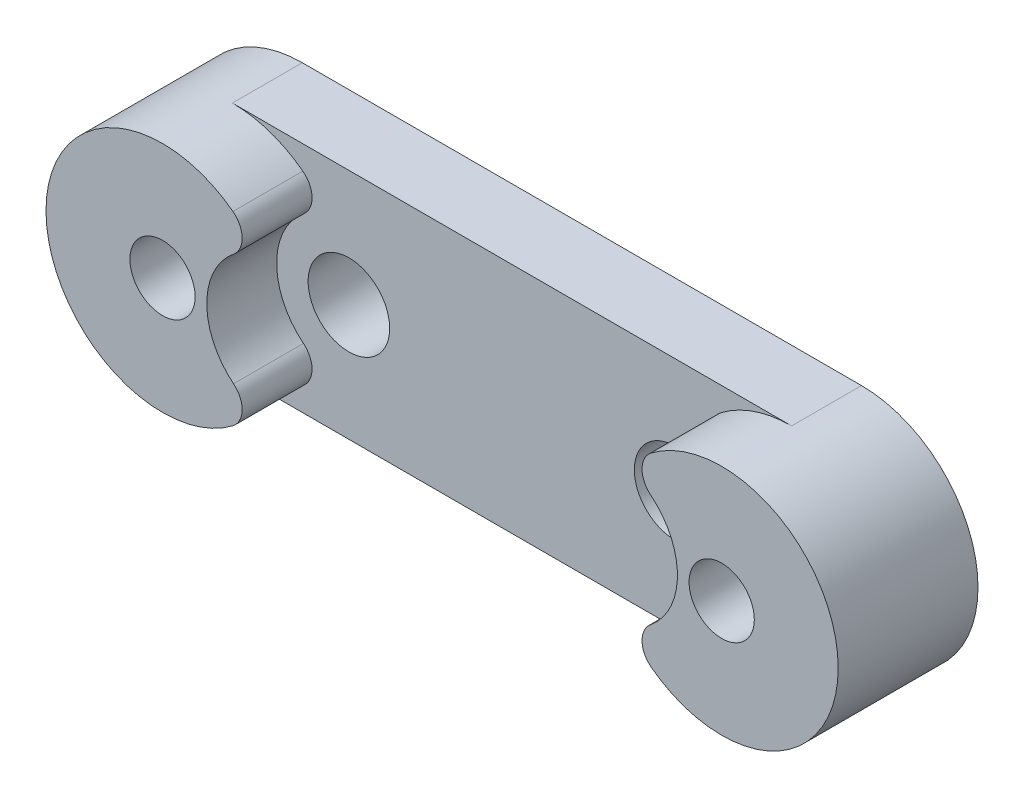
ISO-10303-21;
HEADER;
FILE_DESCRIPTION(('STEP AP214'),'2;1');
FILE_NAME('part.step','',(''),(''),'','','');
FILE_SCHEMA(('AUTOMOTIVE_DESIGN { 1 0 10303 214 1 1 1 1 }'));
ENDSEC;
DATA;
#1=APPLICATION_CONTEXT('core data for automotive mechanical design processes');
#2=APPLICATION_PROTOCOL_DEFINITION('international standard','automotive_design',2000,#1);
#3=PRODUCT_CONTEXT('',#1,'mechanical');
#4=PRODUCT('Part','Part','',(#3));
#5=PRODUCT_RELATED_PRODUCT_CATEGORY('part','',(#4));
#6=PRODUCT_DEFINITION_FORMATION('','',#4);
#7=PRODUCT_DEFINITION_CONTEXT('part definition',#1,'design');
#8=PRODUCT_DEFINITION('design','',#6,#7);
#9=PRODUCT_DEFINITION_SHAPE('','',#8);
#10=(LENGTH_UNIT() NAMED_UNIT(*) SI_UNIT(.MILLI.,.METRE.));
#11=(NAMED_UNIT(*) PLANE_ANGLE_UNIT() SI_UNIT($,.RADIAN.));
#12=(NAMED_UNIT(*) SI_UNIT($,.STERADIAN.) SOLID_ANGLE_UNIT());
#13=UNCERTAINTY_MEASURE_WITH_UNIT(LENGTH_MEASURE(1.E-05),#10,'distance_accuracy_value','');
#14=(GEOMETRIC_REPRESENTATION_CONTEXT(3) GLOBAL_UNCERTAINTY_ASSIGNED_CONTEXT((#13)) GLOBAL_UNIT_ASSIGNED_CONTEXT((#10,
#11,#12)) REPRESENTATION_CONTEXT('',''));
#15=CARTESIAN_POINT('',(0.,0.,0.));
#16=DIRECTION('',(0.,0.,1.));
#17=DIRECTION('',(1.,0.,0.));
#18=AXIS2_PLACEMENT_3D('',#15,#16,#17);
#19=CARTESIAN_POINT('',(-12.,0.,3.));
#20=DIRECTION('',(0.,0.,1.));
#21=DIRECTION('',(1.,0.,0.));
#22=AXIS2_PLACEMENT_3D('',#19,#20,#21);
#23=PLANE('',#22);
#24=CARTESIAN_POINT('',(7.,0.,3.));
#25=DIRECTION('',(0.,0.,1.));
#26=DIRECTION('',(-1.,0.,0.));
#27=AXIS2_PLACEMENT_3D('',#24,#25,#26);
#28=CIRCLE('',#27,1.75);
#29=CARTESIAN_POINT('',(5.25,0.,3.));
#30=VERTEX_POINT('',#29);
#31=EDGE_CURVE('E234',#30,#30,#28,.T.);
#32=ORIENTED_EDGE('',*,*,#31,.F.);
#33=EDGE_LOOP('',(#32));
#34=FACE_BOUND('',#33,.T.);
#35=CARTESIAN_POINT('',(-7.,0.,3.));
#36=DIRECTION('',(0.,0.,1.));
#37=DIRECTION('',(1.,0.,0.));
#38=AXIS2_PLACEMENT_3D('',#35,#36,#37);
#39=CIRCLE('',#38,1.75);
#40=CARTESIAN_POINT('',(-5.25,0.,3.));
#41=VERTEX_POINT('',#40);
#42=EDGE_CURVE('E240',#41,#41,#39,.T.);
#43=ORIENTED_EDGE('',*,*,#42,.F.);
#44=EDGE_LOOP('',(#43));
#45=FACE_BOUND('',#44,.T.);
#46=CARTESIAN_POINT('',(12.,0.,3.));
#47=DIRECTION('',(0.,0.,1.));
#48=DIRECTION('',(1.,0.,0.));
#49=AXIS2_PLACEMENT_3D('',#46,#47,#48);
#50=CIRCLE('',#49,5.);
#51=CARTESIAN_POINT('',(8.97625,-3.98207683721698,3.));
#52=VERTEX_POINT('',#51);
#53=CARTESIAN_POINT('',(12.,-5.,3.));
#54=VERTEX_POINT('',#53);
#55=EDGE_CURVE('E187',#52,#54,#50,.T.);
#56=ORIENTED_EDGE('',*,*,#55,.F.);
#57=CARTESIAN_POINT('',(9.581,-3.18566146977358,3.));
#58=DIRECTION('',(0.,0.,1.));
#59=DIRECTION('',(1.,0.,0.));
#60=AXIS2_PLACEMENT_3D('',#57,#58,#59);
#61=CIRCLE('',#60,1.);
#62=CARTESIAN_POINT('',(8.95148780487805,-2.40867086738978,3.));
#63=VERTEX_POINT('',#62);
#64=EDGE_CURVE('E181',#52,#63,#61,.F.);
#65=ORIENTED_EDGE('',*,*,#64,.T.);
#66=CARTESIAN_POINT('',(7.,0.,3.));
#67=DIRECTION('',(0.,0.,1.));
#68=DIRECTION('',(1.,0.,0.));
#69=AXIS2_PLACEMENT_3D('',#66,#67,#68);
#70=CIRCLE('',#69,3.1);
#71=CARTESIAN_POINT('',(8.95148780487805,2.40867086738978,3.));
#72=VERTEX_POINT('',#71);
#73=EDGE_CURVE('E185',#72,#63,#70,.F.);
#74=ORIENTED_EDGE('',*,*,#73,.F.);
#75=CARTESIAN_POINT('',(9.581,3.18566146977359,3.));
#76=DIRECTION('',(0.,0.,1.));
#77=DIRECTION('',(1.,0.,0.));
#78=AXIS2_PLACEMENT_3D('',#75,#76,#77);
#79=CIRCLE('',#78,1.);
#80=CARTESIAN_POINT('',(8.97624999999999,3.98207683721698,3.));
#81=VERTEX_POINT('',#80);
#82=EDGE_CURVE('E179',#72,#81,#79,.F.);
#83=ORIENTED_EDGE('',*,*,#82,.T.);
#84=CARTESIAN_POINT('',(12.,5.,3.));
#85=VERTEX_POINT('',#84);
#86=EDGE_CURVE('E219',#85,#81,#50,.T.);
#87=ORIENTED_EDGE('',*,*,#86,.F.);
#88=DIRECTION('',(-1.,0.,0.));
#89=VECTOR('',#88,1.);
#90=CARTESIAN_POINT('',(-12.,5.,3.));
#91=LINE('',#90,#89);
#92=CARTESIAN_POINT('',(-12.,5.,3.));
#93=VERTEX_POINT('',#92);
#94=EDGE_CURVE('E141',#85,#93,#91,.T.);
#95=ORIENTED_EDGE('',*,*,#94,.T.);
#96=CARTESIAN_POINT('',(-12.,0.,3.));
#97=DIRECTION('',(0.,0.,1.));
#98=DIRECTION('',(1.,0.,0.));
#99=AXIS2_PLACEMENT_3D('',#96,#97,#98);
#100=CIRCLE('',#99,5.);
#101=CARTESIAN_POINT('',(-8.97625,3.98207683721698,3.));
#102=VERTEX_POINT('',#101);
#103=EDGE_CURVE('E131',#102,#93,#100,.T.);
#104=ORIENTED_EDGE('',*,*,#103,.F.);
#105=CARTESIAN_POINT('',(-9.581,3.18566146977359,3.));
#106=DIRECTION('',(0.,0.,1.));
#107=DIRECTION('',(1.,0.,0.));
#108=AXIS2_PLACEMENT_3D('',#105,#106,#107);
#109=CIRCLE('',#108,1.);
#110=CARTESIAN_POINT('',(-8.95148780487805,2.40867086738978,3.));
#111=VERTEX_POINT('',#110);
#112=EDGE_CURVE('E11',#102,#111,#109,.F.);
#113=ORIENTED_EDGE('',*,*,#112,.T.);
#114=CARTESIAN_POINT('',(-7.,0.,3.));
#115=DIRECTION('',(0.,0.,1.));
#116=DIRECTION('',(1.,0.,0.));
#117=AXIS2_PLACEMENT_3D('',#114,#115,#116);
#118=CIRCLE('',#117,3.1);
#119=CARTESIAN_POINT('',(-8.95148780487805,-2.40867086738978,3.));
#120=VERTEX_POINT('',#119);
#121=EDGE_CURVE('E231',#120,#111,#118,.F.);
#122=ORIENTED_EDGE('',*,*,#121,.F.);
#123=CARTESIAN_POINT('',(-9.581,-3.18566146977359,3.));
#124=DIRECTION('',(0.,0.,1.));
#125=DIRECTION('',(1.,0.,0.));
#126=AXIS2_PLACEMENT_3D('',#123,#124,#125);
#127=CIRCLE('',#126,1.);
#128=CARTESIAN_POINT('',(-8.97625,-3.98207683721698,3.));
#129=VERTEX_POINT('',#128);
#130=EDGE_CURVE('E41',#120,#129,#127,.F.);
#131=ORIENTED_EDGE('',*,*,#130,.T.);
#132=CARTESIAN_POINT('',(-12.,-5.,3.));
#133=VERTEX_POINT('',#132);
#134=EDGE_CURVE('E121',#133,#129,#100,.T.);
#135=ORIENTED_EDGE('',*,*,#134,.F.);
#136=DIRECTION('',(1.,0.,0.));
#137=VECTOR('',#136,1.);
#138=CARTESIAN_POINT('',(-12.,-5.,3.));
#139=LINE('',#138,#137);
#140=EDGE_CURVE('E124',#133,#54,#139,.T.);
#141=ORIENTED_EDGE('',*,*,#140,.T.);
#142=EDGE_LOOP('',(#56,#65,#74,#83,#87,#95,#104,#113,#122,#131,#135,#141));
#143=FACE_BOUND('',#142,.T.);
#144=ADVANCED_FACE('F33',(#34,#45,#143),#23,.T.);
#145=CARTESIAN_POINT('',(-12.,0.,0.));
#146=DIRECTION('',(0.,0.,1.));
#147=DIRECTION('',(1.,0.,0.));
#148=AXIS2_PLACEMENT_3D('',#145,#146,#147);
#149=PLANE('',#148);
#150=CARTESIAN_POINT('',(12.,0.,0.));
#151=DIRECTION('',(0.,0.,1.));
#152=DIRECTION('',(1.,0.,0.));
#153=AXIS2_PLACEMENT_3D('',#150,#151,#152);
#154=CIRCLE('',#153,5.);
#155=CARTESIAN_POINT('',(12.,-5.,0.));
#156=VERTEX_POINT('',#155);
#157=CARTESIAN_POINT('',(12.,5.,0.));
#158=VERTEX_POINT('',#157);
#159=EDGE_CURVE('E251',#156,#158,#154,.T.);
#160=ORIENTED_EDGE('',*,*,#159,.F.);
#161=DIRECTION('',(1.,0.,0.));
#162=VECTOR('',#161,1.);
#163=CARTESIAN_POINT('',(-12.,-5.,0.));
#164=LINE('',#163,#162);
#165=CARTESIAN_POINT('',(-12.,-5.,0.));
#166=VERTEX_POINT('',#165);
#167=EDGE_CURVE('E249',#166,#156,#164,.T.);
#168=ORIENTED_EDGE('',*,*,#167,.F.);
#169=CARTESIAN_POINT('',(-12.,0.,0.));
#170=DIRECTION('',(0.,0.,1.));
#171=DIRECTION('',(1.,0.,0.));
#172=AXIS2_PLACEMENT_3D('',#169,#170,#171);
#173=CIRCLE('',#172,5.);
#174=CARTESIAN_POINT('',(-12.,5.,0.));
#175=VERTEX_POINT('',#174);
#176=EDGE_CURVE('E147',#175,#166,#173,.T.);
#177=ORIENTED_EDGE('',*,*,#176,.F.);
#178=DIRECTION('',(-1.,0.,0.));
#179=VECTOR('',#178,1.);
#180=CARTESIAN_POINT('',(-12.,5.,0.));
#181=LINE('',#180,#179);
#182=EDGE_CURVE('E142',#158,#175,#181,.T.);
#183=ORIENTED_EDGE('',*,*,#182,.F.);
#184=EDGE_LOOP('',(#160,#168,#177,#183));
#185=FACE_BOUND('',#184,.T.);
#186=CARTESIAN_POINT('',(12.,0.,0.));
#187=DIRECTION('',(0.,0.,1.));
#188=DIRECTION('',(1.,0.,0.));
#189=AXIS2_PLACEMENT_3D('',#186,#187,#188);
#190=CIRCLE('',#189,1.4);
#191=CARTESIAN_POINT('',(13.4,0.,0.));
#192=VERTEX_POINT('',#191);
#193=EDGE_CURVE('E212',#192,#192,#190,.T.);
#194=ORIENTED_EDGE('',*,*,#193,.T.);
#195=EDGE_LOOP('',(#194));
#196=FACE_BOUND('',#195,.T.);
#197=CARTESIAN_POINT('',(-12.,0.,0.));
#198=DIRECTION('',(0.,0.,1.));
#199=DIRECTION('',(1.,0.,0.));
#200=AXIS2_PLACEMENT_3D('',#197,#198,#199);
#201=CIRCLE('',#200,1.4);
#202=CARTESIAN_POINT('',(-10.6,0.,0.));
#203=VERTEX_POINT('',#202);
#204=EDGE_CURVE('E132',#203,#203,#201,.T.);
#205=ORIENTED_EDGE('',*,*,#204,.T.);
#206=EDGE_LOOP('',(#205));
#207=FACE_BOUND('',#206,.T.);
#208=CARTESIAN_POINT('',(7.,0.,0.));
#209=DIRECTION('',(0.,0.,1.));
#210=DIRECTION('',(-1.,0.,0.));
#211=AXIS2_PLACEMENT_3D('',#208,#209,#210);
#212=CIRCLE('',#211,1.75);
#213=CARTESIAN_POINT('',(5.25,0.,0.));
#214=VERTEX_POINT('',#213);
#215=EDGE_CURVE('E233',#214,#214,#212,.T.);
#216=ORIENTED_EDGE('',*,*,#215,.T.);
#217=EDGE_LOOP('',(#216));
#218=FACE_BOUND('',#217,.T.);
#219=CARTESIAN_POINT('',(-7.,0.,0.));
#220=DIRECTION('',(0.,0.,1.));
#221=DIRECTION('',(1.,0.,0.));
#222=AXIS2_PLACEMENT_3D('',#219,#220,#221);
#223=CIRCLE('',#222,1.75);
#224=CARTESIAN_POINT('',(-5.25,0.,0.));
#225=VERTEX_POINT('',#224);
#226=EDGE_CURVE('E237',#225,#225,#223,.T.);
#227=ORIENTED_EDGE('',*,*,#226,.T.);
#228=EDGE_LOOP('',(#227));
#229=FACE_BOUND('',#228,.T.);
#230=ADVANCED_FACE('F263',(#185,#196,#207,#218,#229),#149,.F.);
#231=CARTESIAN_POINT('',(-12.,0.,3.));
#232=DIRECTION('',(0.,0.,-1.));
#233=DIRECTION('',(-1.,0.,0.));
#234=AXIS2_PLACEMENT_3D('',#231,#232,#233);
#235=CYLINDRICAL_SURFACE('',#234,5.);
#236=ORIENTED_EDGE('',*,*,#134,.T.);
#237=DIRECTION('',(0.,0.,-1.));
#238=VECTOR('',#237,1.);
#239=CARTESIAN_POINT('',(-8.97625,-3.98207683721698,3.));
#240=LINE('',#239,#238);
#241=CARTESIAN_POINT('',(-8.97625,-3.98207683721698,6.));
#242=VERTEX_POINT('',#241);
#243=EDGE_CURVE('E169',#129,#242,#240,.F.);
#244=ORIENTED_EDGE('',*,*,#243,.T.);
#245=CARTESIAN_POINT('',(-12.,0.,6.));
#246=DIRECTION('',(0.,0.,1.));
#247=DIRECTION('',(1.,0.,0.));
#248=AXIS2_PLACEMENT_3D('',#245,#246,#247);
#249=CIRCLE('',#248,5.);
#250=CARTESIAN_POINT('',(-8.97625,3.98207683721698,6.));
#251=VERTEX_POINT('',#250);
#252=EDGE_CURVE('E226',#251,#242,#249,.T.);
#253=ORIENTED_EDGE('',*,*,#252,.F.);
#254=DIRECTION('',(0.,0.,-1.));
#255=VECTOR('',#254,1.);
#256=CARTESIAN_POINT('',(-8.97625,3.98207683721698,3.));
#257=LINE('',#256,#255);
#258=EDGE_CURVE('E167',#251,#102,#257,.T.);
#259=ORIENTED_EDGE('',*,*,#258,.T.);
#260=ORIENTED_EDGE('',*,*,#103,.T.);
#261=DIRECTION('',(0.,0.,-1.));
#262=VECTOR('',#261,1.);
#263=CARTESIAN_POINT('',(-12.,5.,3.));
#264=LINE('',#263,#262);
#265=EDGE_CURVE('E247',#93,#175,#264,.T.);
#266=ORIENTED_EDGE('',*,*,#265,.T.);
#267=ORIENTED_EDGE('',*,*,#176,.T.);
#268=DIRECTION('',(0.,0.,-1.));
#269=VECTOR('',#268,1.);
#270=CARTESIAN_POINT('',(-12.,-5.,3.));
#271=LINE('',#270,#269);
#272=EDGE_CURVE('E137',#133,#166,#271,.T.);
#273=ORIENTED_EDGE('',*,*,#272,.F.);
#274=EDGE_LOOP('',(#236,#244,#253,#259,#260,#266,#267,#273));
#275=FACE_BOUND('',#274,.T.);
#276=ADVANCED_FACE('F144',(#275),#235,.T.);
#277=CARTESIAN_POINT('',(-12.,-5.,3.));
#278=DIRECTION('',(0.,1.,0.));
#279=DIRECTION('',(0.,0.,1.));
#280=AXIS2_PLACEMENT_3D('',#277,#278,#279);
#281=PLANE('',#280);
#282=ORIENTED_EDGE('',*,*,#167,.T.);
#283=DIRECTION('',(0.,0.,-1.));
#284=VECTOR('',#283,1.);
#285=CARTESIAN_POINT('',(12.,-5.,3.));
#286=LINE('',#285,#284);
#287=EDGE_CURVE('E140',#54,#156,#286,.T.);
#288=ORIENTED_EDGE('',*,*,#287,.F.);
#289=ORIENTED_EDGE('',*,*,#140,.F.);
#290=ORIENTED_EDGE('',*,*,#272,.T.);
#291=EDGE_LOOP('',(#282,#288,#289,#290));
#292=FACE_BOUND('',#291,.T.);
#293=ADVANCED_FACE('F136',(#292),#281,.F.);
#294=CARTESIAN_POINT('',(12.,0.,3.));
#295=DIRECTION('',(0.,0.,-1.));
#296=DIRECTION('',(-1.,0.,0.));
#297=AXIS2_PLACEMENT_3D('',#294,#295,#296);
#298=CYLINDRICAL_SURFACE('',#297,5.);
#299=ORIENTED_EDGE('',*,*,#86,.T.);
#300=DIRECTION('',(0.,0.,-1.));
#301=VECTOR('',#300,1.);
#302=CARTESIAN_POINT('',(8.97624999999999,3.98207683721698,3.));
#303=LINE('',#302,#301);
#304=CARTESIAN_POINT('',(8.97624999999999,3.98207683721698,6.));
#305=VERTEX_POINT('',#304);
#306=EDGE_CURVE('E150',#81,#305,#303,.F.);
#307=ORIENTED_EDGE('',*,*,#306,.T.);
#308=CARTESIAN_POINT('',(12.,0.,6.));
#309=DIRECTION('',(0.,0.,1.));
#310=DIRECTION('',(-1.,0.,0.));
#311=AXIS2_PLACEMENT_3D('',#308,#309,#310);
#312=CIRCLE('',#311,5.);
#313=CARTESIAN_POINT('',(8.97625,-3.98207683721698,6.));
#314=VERTEX_POINT('',#313);
#315=EDGE_CURVE('E204',#314,#305,#312,.T.);
#316=ORIENTED_EDGE('',*,*,#315,.F.);
#317=DIRECTION('',(0.,0.,-1.));
#318=VECTOR('',#317,1.);
#319=CARTESIAN_POINT('',(8.97625,-3.98207683721698,3.));
#320=LINE('',#319,#318);
#321=EDGE_CURVE('E148',#314,#52,#320,.T.);
#322=ORIENTED_EDGE('',*,*,#321,.T.);
#323=ORIENTED_EDGE('',*,*,#55,.T.);
#324=ORIENTED_EDGE('',*,*,#287,.T.);
#325=ORIENTED_EDGE('',*,*,#159,.T.);
#326=DIRECTION('',(0.,0.,-1.));
#327=VECTOR('',#326,1.);
#328=CARTESIAN_POINT('',(12.,5.,3.));
#329=LINE('',#328,#327);
#330=EDGE_CURVE('E152',#85,#158,#329,.T.);
#331=ORIENTED_EDGE('',*,*,#330,.F.);
#332=EDGE_LOOP('',(#299,#307,#316,#322,#323,#324,#325,#331));
#333=FACE_BOUND('',#332,.T.);
#334=ADVANCED_FACE('F208',(#333),#298,.T.);
#335=CARTESIAN_POINT('',(-12.,5.,3.));
#336=DIRECTION('',(0.,-1.,0.));
#337=DIRECTION('',(1.,0.,0.));
#338=AXIS2_PLACEMENT_3D('',#335,#336,#337);
#339=PLANE('',#338);
#340=ORIENTED_EDGE('',*,*,#182,.T.);
#341=ORIENTED_EDGE('',*,*,#265,.F.);
#342=ORIENTED_EDGE('',*,*,#94,.F.);
#343=ORIENTED_EDGE('',*,*,#330,.T.);
#344=EDGE_LOOP('',(#340,#341,#342,#343));
#345=FACE_BOUND('',#344,.T.);
#346=ADVANCED_FACE('F259',(#345),#339,.F.);
#347=CARTESIAN_POINT('',(-7.,0.,3.));
#348=DIRECTION('',(0.,0.,-1.));
#349=DIRECTION('',(-1.,0.,0.));
#350=AXIS2_PLACEMENT_3D('',#347,#348,#349);
#351=CYLINDRICAL_SURFACE('',#350,1.75);
#352=ORIENTED_EDGE('',*,*,#42,.T.);
#353=EDGE_LOOP('',(#352));
#354=FACE_BOUND('',#353,.T.);
#355=ORIENTED_EDGE('',*,*,#226,.F.);
#356=EDGE_LOOP('',(#355));
#357=FACE_BOUND('',#356,.T.);
#358=ADVANCED_FACE('F275',(#354,#357),#351,.F.);
#359=CARTESIAN_POINT('',(7.,0.,3.));
#360=DIRECTION('',(0.,0.,-1.));
#361=DIRECTION('',(-1.,0.,0.));
#362=AXIS2_PLACEMENT_3D('',#359,#360,#361);
#363=CYLINDRICAL_SURFACE('',#362,1.75);
#364=ORIENTED_EDGE('',*,*,#31,.T.);
#365=EDGE_LOOP('',(#364));
#366=FACE_BOUND('',#365,.T.);
#367=ORIENTED_EDGE('',*,*,#215,.F.);
#368=EDGE_LOOP('',(#367));
#369=FACE_BOUND('',#368,.T.);
#370=ADVANCED_FACE('F277',(#366,#369),#363,.F.);
#371=CARTESIAN_POINT('',(-7.,0.,0.));
#372=DIRECTION('',(0.,0.,1.));
#373=DIRECTION('',(1.,0.,0.));
#374=AXIS2_PLACEMENT_3D('',#371,#372,#373);
#375=CYLINDRICAL_SURFACE('',#374,3.1);
#376=CARTESIAN_POINT('',(-7.,0.,6.));
#377=DIRECTION('',(0.,0.,-1.));
#378=DIRECTION('',(1.,0.,0.));
#379=AXIS2_PLACEMENT_3D('',#376,#377,#378);
#380=CIRCLE('',#379,3.1);
#381=CARTESIAN_POINT('',(-8.95148780487805,-2.40867086738978,6.));
#382=VERTEX_POINT('',#381);
#383=CARTESIAN_POINT('',(-8.95148780487805,2.40867086738978,6.));
#384=VERTEX_POINT('',#383);
#385=EDGE_CURVE('E223',#382,#384,#380,.T.);
#386=ORIENTED_EDGE('',*,*,#385,.F.);
#387=DIRECTION('',(0.,0.,1.));
#388=VECTOR('',#387,1.);
#389=CARTESIAN_POINT('',(-8.95148780487805,-2.40867086738978,0.));
#390=LINE('',#389,#388);
#391=EDGE_CURVE('E53',#382,#120,#390,.F.);
#392=ORIENTED_EDGE('',*,*,#391,.T.);
#393=ORIENTED_EDGE('',*,*,#121,.T.);
#394=DIRECTION('',(0.,0.,1.));
#395=VECTOR('',#394,1.);
#396=CARTESIAN_POINT('',(-8.95148780487805,2.40867086738978,0.));
#397=LINE('',#396,#395);
#398=EDGE_CURVE('E175',#111,#384,#397,.T.);
#399=ORIENTED_EDGE('',*,*,#398,.T.);
#400=EDGE_LOOP('',(#386,#392,#393,#399));
#401=FACE_BOUND('',#400,.T.);
#402=ADVANCED_FACE('F284',(#401),#375,.F.);
#403=CARTESIAN_POINT('',(-12.,0.,0.));
#404=DIRECTION('',(0.,0.,1.));
#405=DIRECTION('',(1.,0.,0.));
#406=AXIS2_PLACEMENT_3D('',#403,#404,#405);
#407=CYLINDRICAL_SURFACE('',#406,1.4);
#408=ORIENTED_EDGE('',*,*,#204,.F.);
#409=EDGE_LOOP('',(#408));
#410=FACE_BOUND('',#409,.T.);
#411=CARTESIAN_POINT('',(-12.,0.,6.));
#412=DIRECTION('',(0.,0.,1.));
#413=DIRECTION('',(1.,0.,0.));
#414=AXIS2_PLACEMENT_3D('',#411,#412,#413);
#415=CIRCLE('',#414,1.4);
#416=CARTESIAN_POINT('',(-10.6,0.,6.));
#417=VERTEX_POINT('',#416);
#418=EDGE_CURVE('E196',#417,#417,#415,.T.);
#419=ORIENTED_EDGE('',*,*,#418,.T.);
#420=EDGE_LOOP('',(#419));
#421=FACE_BOUND('',#420,.T.);
#422=ADVANCED_FACE('F321',(#410,#421),#407,.F.);
#423=CARTESIAN_POINT('',(-9.5,0.,6.));
#424=DIRECTION('',(0.,0.,1.));
#425=DIRECTION('',(1.,0.,0.));
#426=AXIS2_PLACEMENT_3D('',#423,#424,#425);
#427=PLANE('',#426);
#428=ORIENTED_EDGE('',*,*,#252,.T.);
#429=CARTESIAN_POINT('',(-9.581,-3.18566146977359,6.));
#430=DIRECTION('',(0.,0.,1.));
#431=DIRECTION('',(1.,0.,0.));
#432=AXIS2_PLACEMENT_3D('',#429,#430,#431);
#433=CIRCLE('',#432,1.);
#434=EDGE_CURVE('E173',#242,#382,#433,.T.);
#435=ORIENTED_EDGE('',*,*,#434,.T.);
#436=ORIENTED_EDGE('',*,*,#385,.T.);
#437=CARTESIAN_POINT('',(-9.581,3.18566146977359,6.));
#438=DIRECTION('',(0.,0.,1.));
#439=DIRECTION('',(1.,0.,0.));
#440=AXIS2_PLACEMENT_3D('',#437,#438,#439);
#441=CIRCLE('',#440,1.);
#442=EDGE_CURVE('E171',#384,#251,#441,.T.);
#443=ORIENTED_EDGE('',*,*,#442,.T.);
#444=EDGE_LOOP('',(#428,#435,#436,#443));
#445=FACE_BOUND('',#444,.T.);
#446=ORIENTED_EDGE('',*,*,#418,.F.);
#447=EDGE_LOOP('',(#446));
#448=FACE_BOUND('',#447,.T.);
#449=ADVANCED_FACE('F317',(#445,#448),#427,.T.);
#450=CARTESIAN_POINT('',(7.,0.,0.));
#451=DIRECTION('',(0.,0.,1.));
#452=DIRECTION('',(1.,0.,0.));
#453=AXIS2_PLACEMENT_3D('',#450,#451,#452);
#454=CYLINDRICAL_SURFACE('',#453,3.1);
#455=CARTESIAN_POINT('',(7.,0.,6.));
#456=DIRECTION('',(0.,0.,-1.));
#457=DIRECTION('',(-1.,0.,0.));
#458=AXIS2_PLACEMENT_3D('',#455,#456,#457);
#459=CIRCLE('',#458,3.1);
#460=CARTESIAN_POINT('',(8.95148780487805,2.40867086738978,6.));
#461=VERTEX_POINT('',#460);
#462=CARTESIAN_POINT('',(8.95148780487805,-2.40867086738978,6.));
#463=VERTEX_POINT('',#462);
#464=EDGE_CURVE('E205',#461,#463,#459,.T.);
#465=ORIENTED_EDGE('',*,*,#464,.F.);
#466=DIRECTION('',(0.,0.,1.));
#467=VECTOR('',#466,1.);
#468=CARTESIAN_POINT('',(8.95148780487805,2.40867086738978,0.));
#469=LINE('',#468,#467);
#470=EDGE_CURVE('E165',#461,#72,#469,.F.);
#471=ORIENTED_EDGE('',*,*,#470,.T.);
#472=ORIENTED_EDGE('',*,*,#73,.T.);
#473=DIRECTION('',(0.,0.,1.));
#474=VECTOR('',#473,1.);
#475=CARTESIAN_POINT('',(8.95148780487805,-2.40867086738978,0.));
#476=LINE('',#475,#474);
#477=EDGE_CURVE('E162',#63,#463,#476,.T.);
#478=ORIENTED_EDGE('',*,*,#477,.T.);
#479=EDGE_LOOP('',(#465,#471,#472,#478));
#480=FACE_BOUND('',#479,.T.);
#481=ADVANCED_FACE('F193',(#480),#454,.F.);
#482=CARTESIAN_POINT('',(12.,0.,0.));
#483=DIRECTION('',(0.,0.,1.));
#484=DIRECTION('',(1.,0.,0.));
#485=AXIS2_PLACEMENT_3D('',#482,#483,#484);
#486=CYLINDRICAL_SURFACE('',#485,1.4);
#487=ORIENTED_EDGE('',*,*,#193,.F.);
#488=EDGE_LOOP('',(#487));
#489=FACE_BOUND('',#488,.T.);
#490=CARTESIAN_POINT('',(12.,0.,6.));
#491=DIRECTION('',(0.,0.,1.));
#492=DIRECTION('',(1.,0.,0.));
#493=AXIS2_PLACEMENT_3D('',#490,#491,#492);
#494=CIRCLE('',#493,1.4);
#495=CARTESIAN_POINT('',(13.4,0.,6.));
#496=VERTEX_POINT('',#495);
#497=EDGE_CURVE('E210',#496,#496,#494,.T.);
#498=ORIENTED_EDGE('',*,*,#497,.T.);
#499=EDGE_LOOP('',(#498));
#500=FACE_BOUND('',#499,.T.);
#501=ADVANCED_FACE('F333',(#489,#500),#486,.F.);
#502=CARTESIAN_POINT('',(9.5,0.,6.));
#503=DIRECTION('',(0.,0.,-1.));
#504=DIRECTION('',(-1.,0.,0.));
#505=AXIS2_PLACEMENT_3D('',#502,#503,#504);
#506=PLANE('',#505);
#507=ORIENTED_EDGE('',*,*,#315,.T.);
#508=CARTESIAN_POINT('',(9.581,3.18566146977359,6.));
#509=DIRECTION('',(0.,0.,-1.));
#510=DIRECTION('',(-1.,0.,0.));
#511=AXIS2_PLACEMENT_3D('',#508,#509,#510);
#512=CIRCLE('',#511,1.);
#513=EDGE_CURVE('E160',#305,#461,#512,.F.);
#514=ORIENTED_EDGE('',*,*,#513,.T.);
#515=ORIENTED_EDGE('',*,*,#464,.T.);
#516=CARTESIAN_POINT('',(9.581,-3.18566146977358,6.));
#517=DIRECTION('',(0.,0.,-1.));
#518=DIRECTION('',(-1.,0.,0.));
#519=AXIS2_PLACEMENT_3D('',#516,#517,#518);
#520=CIRCLE('',#519,1.);
#521=EDGE_CURVE('E158',#463,#314,#520,.F.);
#522=ORIENTED_EDGE('',*,*,#521,.T.);
#523=EDGE_LOOP('',(#507,#514,#515,#522));
#524=FACE_BOUND('',#523,.T.);
#525=ORIENTED_EDGE('',*,*,#497,.F.);
#526=EDGE_LOOP('',(#525));
#527=FACE_BOUND('',#526,.T.);
#528=ADVANCED_FACE('F202',(#524,#527),#506,.F.);
#529=CARTESIAN_POINT('',(9.581,3.18566146977359,0.));
#530=DIRECTION('',(0.,0.,-1.));
#531=DIRECTION('',(-1.,0.,0.));
#532=AXIS2_PLACEMENT_3D('',#529,#530,#531);
#533=CYLINDRICAL_SURFACE('',#532,1.);
#534=ORIENTED_EDGE('',*,*,#82,.F.);
#535=ORIENTED_EDGE('',*,*,#470,.F.);
#536=ORIENTED_EDGE('',*,*,#513,.F.);
#537=ORIENTED_EDGE('',*,*,#306,.F.);
#538=EDGE_LOOP('',(#534,#535,#536,#537));
#539=FACE_BOUND('',#538,.T.);
#540=ADVANCED_FACE('F302',(#539),#533,.T.);
#541=CARTESIAN_POINT('',(9.581,-3.18566146977358,3.));
#542=DIRECTION('',(0.,0.,-1.));
#543=DIRECTION('',(-1.,0.,0.));
#544=AXIS2_PLACEMENT_3D('',#541,#542,#543);
#545=CYLINDRICAL_SURFACE('',#544,1.);
#546=ORIENTED_EDGE('',*,*,#64,.F.);
#547=ORIENTED_EDGE('',*,*,#321,.F.);
#548=ORIENTED_EDGE('',*,*,#521,.F.);
#549=ORIENTED_EDGE('',*,*,#477,.F.);
#550=EDGE_LOOP('',(#546,#547,#548,#549));
#551=FACE_BOUND('',#550,.T.);
#552=ADVANCED_FACE('F198',(#551),#545,.T.);
#553=CARTESIAN_POINT('',(-9.581,-3.18566146977359,0.));
#554=DIRECTION('',(0.,0.,-1.));
#555=DIRECTION('',(-1.,0.,0.));
#556=AXIS2_PLACEMENT_3D('',#553,#554,#555);
#557=CYLINDRICAL_SURFACE('',#556,1.);
#558=ORIENTED_EDGE('',*,*,#130,.F.);
#559=ORIENTED_EDGE('',*,*,#391,.F.);
#560=ORIENTED_EDGE('',*,*,#434,.F.);
#561=ORIENTED_EDGE('',*,*,#243,.F.);
#562=EDGE_LOOP('',(#558,#559,#560,#561));
#563=FACE_BOUND('',#562,.T.);
#564=ADVANCED_FACE('F307',(#563),#557,.T.);
#565=CARTESIAN_POINT('',(-9.581,3.18566146977359,3.));
#566=DIRECTION('',(0.,0.,-1.));
#567=DIRECTION('',(-1.,0.,0.));
#568=AXIS2_PLACEMENT_3D('',#565,#566,#567);
#569=CYLINDRICAL_SURFACE('',#568,1.);
#570=ORIENTED_EDGE('',*,*,#112,.F.);
#571=ORIENTED_EDGE('',*,*,#258,.F.);
#572=ORIENTED_EDGE('',*,*,#442,.F.);
#573=ORIENTED_EDGE('',*,*,#398,.F.);
#574=EDGE_LOOP('',(#570,#571,#572,#573));
#575=FACE_BOUND('',#574,.T.);
#576=ADVANCED_FACE('F35',(#575),#569,.T.);
#577=CLOSED_SHELL('',(#144,#230,#276,#293,#334,#346,#358,#370,#402,#422,#449,#481,#501,#528,
#540,#552,#564,#576));
#578=MANIFOLD_SOLID_BREP('B2',#577);
#579=ADVANCED_BREP_SHAPE_REPRESENTATION('',(#18,#578),#14);
#580=SHAPE_DEFINITION_REPRESENTATION(#9,#579);
ENDSEC;
END-ISO-10303-21;
